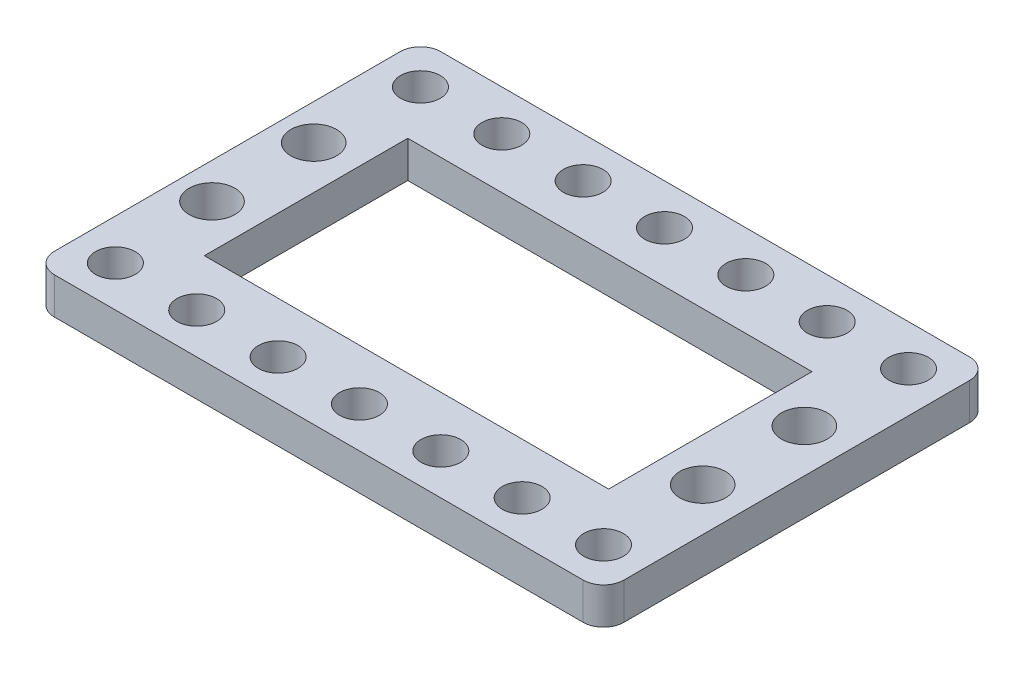
ISO-10303-21;
HEADER;
FILE_DESCRIPTION(('STEP AP214'),'2;1');
FILE_NAME('part.step','',(''),(''),'','','');
FILE_SCHEMA(('AUTOMOTIVE_DESIGN { 1 0 10303 214 1 1 1 1 }'));
ENDSEC;
DATA;
#1=APPLICATION_CONTEXT('core data for automotive mechanical design processes');
#2=APPLICATION_PROTOCOL_DEFINITION('international standard','automotive_design',2000,#1);
#3=PRODUCT_CONTEXT('',#1,'mechanical');
#4=PRODUCT('Part','Part','',(#3));
#5=PRODUCT_RELATED_PRODUCT_CATEGORY('part','',(#4));
#6=PRODUCT_DEFINITION_FORMATION('','',#4);
#7=PRODUCT_DEFINITION_CONTEXT('part definition',#1,'design');
#8=PRODUCT_DEFINITION('design','',#6,#7);
#9=PRODUCT_DEFINITION_SHAPE('','',#8);
#10=(LENGTH_UNIT() NAMED_UNIT(*) SI_UNIT(.MILLI.,.METRE.));
#11=(NAMED_UNIT(*) PLANE_ANGLE_UNIT() SI_UNIT($,.RADIAN.));
#12=(NAMED_UNIT(*) SI_UNIT($,.STERADIAN.) SOLID_ANGLE_UNIT());
#13=UNCERTAINTY_MEASURE_WITH_UNIT(LENGTH_MEASURE(1.E-05),#10,'distance_accuracy_value','');
#14=(GEOMETRIC_REPRESENTATION_CONTEXT(3) GLOBAL_UNCERTAINTY_ASSIGNED_CONTEXT((#13)) GLOBAL_UNIT_ASSIGNED_CONTEXT((#10,
#11,#12)) REPRESENTATION_CONTEXT('',''));
#15=CARTESIAN_POINT('',(0.,0.,0.));
#16=DIRECTION('',(0.,0.,1.));
#17=DIRECTION('',(1.,0.,0.));
#18=AXIS2_PLACEMENT_3D('',#15,#16,#17);
#19=CARTESIAN_POINT('',(76.,3.6,2.));
#20=DIRECTION('',(0.,-1.,0.));
#21=DIRECTION('',(0.,0.,-1.));
#22=AXIS2_PLACEMENT_3D('',#19,#20,#21);
#23=CYLINDRICAL_SURFACE('',#22,2.);
#24=DIRECTION('',(0.,-1.,0.));
#25=VECTOR('',#24,1.);
#26=CARTESIAN_POINT('',(76.,3.6,0.));
#27=LINE('',#26,#25);
#28=CARTESIAN_POINT('',(76.,3.6,0.));
#29=VERTEX_POINT('',#28);
#30=CARTESIAN_POINT('',(76.,0.,0.));
#31=VERTEX_POINT('',#30);
#32=EDGE_CURVE('E293',#29,#31,#27,.T.);
#33=ORIENTED_EDGE('',*,*,#32,.F.);
#34=CARTESIAN_POINT('',(76.,3.6,2.));
#35=DIRECTION('',(0.,1.,0.));
#36=DIRECTION('',(0.,0.,1.));
#37=AXIS2_PLACEMENT_3D('',#34,#35,#36);
#38=CIRCLE('',#37,2.);
#39=CARTESIAN_POINT('',(78.,3.6,2.));
#40=VERTEX_POINT('',#39);
#41=EDGE_CURVE('E41',#40,#29,#38,.T.);
#42=ORIENTED_EDGE('',*,*,#41,.F.);
#43=DIRECTION('',(0.,-1.,0.));
#44=VECTOR('',#43,1.);
#45=CARTESIAN_POINT('',(78.,-6.4,2.));
#46=LINE('',#45,#44);
#47=CARTESIAN_POINT('',(78.,0.,2.));
#48=VERTEX_POINT('',#47);
#49=EDGE_CURVE('E296',#48,#40,#46,.F.);
#50=ORIENTED_EDGE('',*,*,#49,.F.);
#51=CARTESIAN_POINT('',(76.,0.,2.));
#52=DIRECTION('',(0.,1.,0.));
#53=DIRECTION('',(0.,0.,1.));
#54=AXIS2_PLACEMENT_3D('',#51,#52,#53);
#55=CIRCLE('',#54,2.);
#56=EDGE_CURVE('E11',#31,#48,#55,.F.);
#57=ORIENTED_EDGE('',*,*,#56,.F.);
#58=EDGE_LOOP('',(#33,#42,#50,#57));
#59=FACE_BOUND('',#58,.T.);
#60=ADVANCED_FACE('F33',(#59),#23,.T.);
#61=CARTESIAN_POINT('',(76.,-6.4,36.));
#62=DIRECTION('',(0.,-1.,0.));
#63=DIRECTION('',(0.,0.,-1.));
#64=AXIS2_PLACEMENT_3D('',#61,#62,#63);
#65=CYLINDRICAL_SURFACE('',#64,2.);
#66=DIRECTION('',(0.,-1.,0.));
#67=VECTOR('',#66,1.);
#68=CARTESIAN_POINT('',(78.,-6.4,36.));
#69=LINE('',#68,#67);
#70=CARTESIAN_POINT('',(78.,3.6,36.));
#71=VERTEX_POINT('',#70);
#72=CARTESIAN_POINT('',(78.,0.,36.));
#73=VERTEX_POINT('',#72);
#74=EDGE_CURVE('E282',#71,#73,#69,.T.);
#75=ORIENTED_EDGE('',*,*,#74,.F.);
#76=CARTESIAN_POINT('',(76.,3.6,36.));
#77=DIRECTION('',(0.,1.,0.));
#78=DIRECTION('',(0.,0.,1.));
#79=AXIS2_PLACEMENT_3D('',#76,#77,#78);
#80=CIRCLE('',#79,2.);
#81=CARTESIAN_POINT('',(76.,3.6,38.));
#82=VERTEX_POINT('',#81);
#83=EDGE_CURVE('E288',#82,#71,#80,.T.);
#84=ORIENTED_EDGE('',*,*,#83,.F.);
#85=DIRECTION('',(0.,-1.,0.));
#86=VECTOR('',#85,1.);
#87=CARTESIAN_POINT('',(76.,3.6,38.));
#88=LINE('',#87,#86);
#89=CARTESIAN_POINT('',(76.,0.,38.));
#90=VERTEX_POINT('',#89);
#91=EDGE_CURVE('E285',#90,#82,#88,.F.);
#92=ORIENTED_EDGE('',*,*,#91,.F.);
#93=CARTESIAN_POINT('',(76.,0.,36.));
#94=DIRECTION('',(0.,1.,0.));
#95=DIRECTION('',(0.,0.,1.));
#96=AXIS2_PLACEMENT_3D('',#93,#94,#95);
#97=CIRCLE('',#96,2.);
#98=EDGE_CURVE('E291',#73,#90,#97,.F.);
#99=ORIENTED_EDGE('',*,*,#98,.F.);
#100=EDGE_LOOP('',(#75,#84,#92,#99));
#101=FACE_BOUND('',#100,.T.);
#102=ADVANCED_FACE('F350',(#101),#65,.T.);
#103=CARTESIAN_POINT('',(24.,-6.4,36.));
#104=DIRECTION('',(0.,1.,0.));
#105=DIRECTION('',(0.,0.,1.));
#106=AXIS2_PLACEMENT_3D('',#103,#104,#105);
#107=CYLINDRICAL_SURFACE('',#106,2.);
#108=DIRECTION('',(0.,1.,0.));
#109=VECTOR('',#108,1.);
#110=CARTESIAN_POINT('',(22.,-6.4,36.));
#111=LINE('',#110,#109);
#112=CARTESIAN_POINT('',(22.,0.,36.));
#113=VERTEX_POINT('',#112);
#114=CARTESIAN_POINT('',(22.,3.6,36.));
#115=VERTEX_POINT('',#114);
#116=EDGE_CURVE('E272',#113,#115,#111,.T.);
#117=ORIENTED_EDGE('',*,*,#116,.F.);
#118=CARTESIAN_POINT('',(24.,0.,36.));
#119=DIRECTION('',(0.,1.,0.));
#120=DIRECTION('',(0.,0.,1.));
#121=AXIS2_PLACEMENT_3D('',#118,#119,#120);
#122=CIRCLE('',#121,2.);
#123=CARTESIAN_POINT('',(24.,0.,38.));
#124=VERTEX_POINT('',#123);
#125=EDGE_CURVE('E278',#124,#113,#122,.F.);
#126=ORIENTED_EDGE('',*,*,#125,.F.);
#127=DIRECTION('',(0.,1.,0.));
#128=VECTOR('',#127,1.);
#129=CARTESIAN_POINT('',(24.,3.6,38.));
#130=LINE('',#129,#128);
#131=CARTESIAN_POINT('',(24.,3.6,38.));
#132=VERTEX_POINT('',#131);
#133=EDGE_CURVE('E275',#132,#124,#130,.F.);
#134=ORIENTED_EDGE('',*,*,#133,.F.);
#135=CARTESIAN_POINT('',(24.,3.6,36.));
#136=DIRECTION('',(0.,1.,0.));
#137=DIRECTION('',(0.,0.,1.));
#138=AXIS2_PLACEMENT_3D('',#135,#136,#137);
#139=CIRCLE('',#138,2.);
#140=EDGE_CURVE('E280',#115,#132,#139,.T.);
#141=ORIENTED_EDGE('',*,*,#140,.F.);
#142=EDGE_LOOP('',(#117,#126,#134,#141));
#143=FACE_BOUND('',#142,.T.);
#144=ADVANCED_FACE('F354',(#143),#107,.T.);
#145=CARTESIAN_POINT('',(24.,-6.4,2.));
#146=DIRECTION('',(0.,-1.,0.));
#147=DIRECTION('',(0.,0.,-1.));
#148=AXIS2_PLACEMENT_3D('',#145,#146,#147);
#149=CYLINDRICAL_SURFACE('',#148,2.);
#150=DIRECTION('',(0.,-1.,0.));
#151=VECTOR('',#150,1.);
#152=CARTESIAN_POINT('',(22.,-6.4,2.));
#153=LINE('',#152,#151);
#154=CARTESIAN_POINT('',(22.,3.6,2.));
#155=VERTEX_POINT('',#154);
#156=CARTESIAN_POINT('',(22.,0.,2.));
#157=VERTEX_POINT('',#156);
#158=EDGE_CURVE('E260',#155,#157,#153,.T.);
#159=ORIENTED_EDGE('',*,*,#158,.F.);
#160=CARTESIAN_POINT('',(24.,3.6,2.));
#161=DIRECTION('',(0.,1.,0.));
#162=DIRECTION('',(0.,0.,1.));
#163=AXIS2_PLACEMENT_3D('',#160,#161,#162);
#164=CIRCLE('',#163,2.);
#165=CARTESIAN_POINT('',(24.,3.6,0.));
#166=VERTEX_POINT('',#165);
#167=EDGE_CURVE('E266',#166,#155,#164,.T.);
#168=ORIENTED_EDGE('',*,*,#167,.F.);
#169=DIRECTION('',(0.,-1.,0.));
#170=VECTOR('',#169,1.);
#171=CARTESIAN_POINT('',(24.,3.6,0.));
#172=LINE('',#171,#170);
#173=CARTESIAN_POINT('',(24.,0.,0.));
#174=VERTEX_POINT('',#173);
#175=EDGE_CURVE('E263',#174,#166,#172,.F.);
#176=ORIENTED_EDGE('',*,*,#175,.F.);
#177=CARTESIAN_POINT('',(24.,0.,2.));
#178=DIRECTION('',(0.,1.,0.));
#179=DIRECTION('',(0.,0.,1.));
#180=AXIS2_PLACEMENT_3D('',#177,#178,#179);
#181=CIRCLE('',#180,2.);
#182=EDGE_CURVE('E269',#157,#174,#181,.F.);
#183=ORIENTED_EDGE('',*,*,#182,.F.);
#184=EDGE_LOOP('',(#159,#168,#176,#183));
#185=FACE_BOUND('',#184,.T.);
#186=ADVANCED_FACE('F366',(#185),#149,.T.);
#187=CARTESIAN_POINT('',(2.00000000000001,3.6,0.));
#188=DIRECTION('',(0.,0.,1.));
#189=DIRECTION('',(1.,0.,0.));
#190=AXIS2_PLACEMENT_3D('',#187,#188,#189);
#191=PLANE('',#190);
#192=DIRECTION('',(-1.,0.,0.));
#193=VECTOR('',#192,1.);
#194=CARTESIAN_POINT('',(2.00000000000001,3.6,0.));
#195=LINE('',#194,#193);
#196=EDGE_CURVE('E247',#29,#166,#195,.T.);
#197=ORIENTED_EDGE('',*,*,#196,.F.);
#198=ORIENTED_EDGE('',*,*,#32,.T.);
#199=DIRECTION('',(-1.,0.,0.));
#200=VECTOR('',#199,1.);
#201=CARTESIAN_POINT('',(2.00000000000001,0.,0.));
#202=LINE('',#201,#200);
#203=EDGE_CURVE('E238',#31,#174,#202,.T.);
#204=ORIENTED_EDGE('',*,*,#203,.T.);
#205=ORIENTED_EDGE('',*,*,#175,.T.);
#206=EDGE_LOOP('',(#197,#198,#204,#205));
#207=FACE_BOUND('',#206,.T.);
#208=ADVANCED_FACE('F358',(#207),#191,.F.);
#209=CARTESIAN_POINT('',(2.,3.6,38.));
#210=DIRECTION('',(0.,0.,-1.));
#211=DIRECTION('',(-1.,0.,0.));
#212=AXIS2_PLACEMENT_3D('',#209,#210,#211);
#213=PLANE('',#212);
#214=DIRECTION('',(1.,0.,0.));
#215=VECTOR('',#214,1.);
#216=CARTESIAN_POINT('',(2.,0.,38.));
#217=LINE('',#216,#215);
#218=EDGE_CURVE('E250',#124,#90,#217,.T.);
#219=ORIENTED_EDGE('',*,*,#218,.T.);
#220=ORIENTED_EDGE('',*,*,#91,.T.);
#221=DIRECTION('',(1.,0.,0.));
#222=VECTOR('',#221,1.);
#223=CARTESIAN_POINT('',(2.,3.6,38.));
#224=LINE('',#223,#222);
#225=EDGE_CURVE('E249',#132,#82,#224,.T.);
#226=ORIENTED_EDGE('',*,*,#225,.F.);
#227=ORIENTED_EDGE('',*,*,#133,.T.);
#228=EDGE_LOOP('',(#219,#220,#226,#227));
#229=FACE_BOUND('',#228,.T.);
#230=ADVANCED_FACE('F328',(#229),#213,.F.);
#231=CARTESIAN_POINT('',(98.,3.6,36.));
#232=DIRECTION('',(0.,1.,0.));
#233=DIRECTION('',(0.,0.,1.));
#234=AXIS2_PLACEMENT_3D('',#231,#232,#233);
#235=PLANE('',#234);
#236=CARTESIAN_POINT('',(73.75,3.6,24.));
#237=DIRECTION('',(0.,1.,0.));
#238=DIRECTION('',(0.,0.,1.));
#239=AXIS2_PLACEMENT_3D('',#236,#237,#238);
#240=CIRCLE('',#239,2.25);
#241=CARTESIAN_POINT('',(73.75,3.6,26.25));
#242=VERTEX_POINT('',#241);
#243=EDGE_CURVE('E607',#242,#242,#240,.T.);
#244=ORIENTED_EDGE('',*,*,#243,.F.);
#245=EDGE_LOOP('',(#244));
#246=FACE_BOUND('',#245,.T.);
#247=CARTESIAN_POINT('',(25.5,3.6,14.));
#248=DIRECTION('',(0.,1.,0.));
#249=DIRECTION('',(0.,0.,1.));
#250=AXIS2_PLACEMENT_3D('',#247,#248,#249);
#251=CIRCLE('',#250,2.25);
#252=CARTESIAN_POINT('',(25.5,3.6,16.25));
#253=VERTEX_POINT('',#252);
#254=EDGE_CURVE('E608',#253,#253,#251,.T.);
#255=ORIENTED_EDGE('',*,*,#254,.F.);
#256=EDGE_LOOP('',(#255));
#257=FACE_BOUND('',#256,.T.);
#258=CARTESIAN_POINT('',(25.5,3.6,24.));
#259=DIRECTION('',(0.,1.,0.));
#260=DIRECTION('',(0.,0.,1.));
#261=AXIS2_PLACEMENT_3D('',#258,#259,#260);
#262=CIRCLE('',#261,2.25);
#263=CARTESIAN_POINT('',(25.5,3.6,26.25));
#264=VERTEX_POINT('',#263);
#265=EDGE_CURVE('E612',#264,#264,#262,.T.);
#266=ORIENTED_EDGE('',*,*,#265,.F.);
#267=EDGE_LOOP('',(#266));
#268=FACE_BOUND('',#267,.T.);
#269=CARTESIAN_POINT('',(73.75,3.6,14.));
#270=DIRECTION('',(0.,1.,0.));
#271=DIRECTION('',(0.,0.,1.));
#272=AXIS2_PLACEMENT_3D('',#269,#270,#271);
#273=CIRCLE('',#272,2.25);
#274=CARTESIAN_POINT('',(73.75,3.6,16.25));
#275=VERTEX_POINT('',#274);
#276=EDGE_CURVE('E303',#275,#275,#273,.T.);
#277=ORIENTED_EDGE('',*,*,#276,.F.);
#278=EDGE_LOOP('',(#277));
#279=FACE_BOUND('',#278,.T.);
#280=DIRECTION('',(0.,0.,1.));
#281=VECTOR('',#280,1.);
#282=CARTESIAN_POINT('',(78.,3.6,0.));
#283=LINE('',#282,#281);
#284=EDGE_CURVE('E158',#40,#71,#283,.T.);
#285=ORIENTED_EDGE('',*,*,#284,.F.);
#286=ORIENTED_EDGE('',*,*,#41,.T.);
#287=ORIENTED_EDGE('',*,*,#196,.T.);
#288=ORIENTED_EDGE('',*,*,#167,.T.);
#289=DIRECTION('',(0.,0.,-1.));
#290=VECTOR('',#289,1.);
#291=CARTESIAN_POINT('',(22.,3.6,0.));
#292=LINE('',#291,#290);
#293=EDGE_CURVE('E310',#115,#155,#292,.T.);
#294=ORIENTED_EDGE('',*,*,#293,.F.);
#295=ORIENTED_EDGE('',*,*,#140,.T.);
#296=ORIENTED_EDGE('',*,*,#225,.T.);
#297=ORIENTED_EDGE('',*,*,#83,.T.);
#298=EDGE_LOOP('',(#285,#286,#287,#288,#294,#295,#296,#297));
#299=FACE_BOUND('',#298,.T.);
#300=CARTESIAN_POINT('',(74.,3.6,4.0047502203254));
#301=DIRECTION('',(0.,1.,0.));
#302=DIRECTION('',(0.,0.,1.));
#303=AXIS2_PLACEMENT_3D('',#300,#301,#302);
#304=CIRCLE('',#303,1.95);
#305=CARTESIAN_POINT('',(74.,3.6,5.9547502203254));
#306=VERTEX_POINT('',#305);
#307=EDGE_CURVE('E184',#306,#306,#304,.T.);
#308=ORIENTED_EDGE('',*,*,#307,.F.);
#309=EDGE_LOOP('',(#308));
#310=FACE_BOUND('',#309,.T.);
#311=CARTESIAN_POINT('',(26.,3.6,34.));
#312=DIRECTION('',(0.,1.,0.));
#313=DIRECTION('',(0.,0.,1.));
#314=AXIS2_PLACEMENT_3D('',#311,#312,#313);
#315=CIRCLE('',#314,1.95);
#316=CARTESIAN_POINT('',(26.,3.6,35.95));
#317=VERTEX_POINT('',#316);
#318=EDGE_CURVE('E185',#317,#317,#315,.T.);
#319=ORIENTED_EDGE('',*,*,#318,.F.);
#320=EDGE_LOOP('',(#319));
#321=FACE_BOUND('',#320,.T.);
#322=CARTESIAN_POINT('',(34.,3.6,34.));
#323=DIRECTION('',(0.,1.,0.));
#324=DIRECTION('',(0.,0.,1.));
#325=AXIS2_PLACEMENT_3D('',#322,#323,#324);
#326=CIRCLE('',#325,1.94999999999999);
#327=CARTESIAN_POINT('',(34.,3.6,35.95));
#328=VERTEX_POINT('',#327);
#329=EDGE_CURVE('E191',#328,#328,#326,.T.);
#330=ORIENTED_EDGE('',*,*,#329,.F.);
#331=EDGE_LOOP('',(#330));
#332=FACE_BOUND('',#331,.T.);
#333=CARTESIAN_POINT('',(42.,3.6,34.));
#334=DIRECTION('',(0.,1.,0.));
#335=DIRECTION('',(0.,0.,1.));
#336=AXIS2_PLACEMENT_3D('',#333,#334,#335);
#337=CIRCLE('',#336,1.95000000000001);
#338=CARTESIAN_POINT('',(42.,3.6,35.95));
#339=VERTEX_POINT('',#338);
#340=EDGE_CURVE('E197',#339,#339,#337,.T.);
#341=ORIENTED_EDGE('',*,*,#340,.F.);
#342=EDGE_LOOP('',(#341));
#343=FACE_BOUND('',#342,.T.);
#344=CARTESIAN_POINT('',(50.,3.6,34.));
#345=DIRECTION('',(0.,1.,0.));
#346=DIRECTION('',(0.,0.,1.));
#347=AXIS2_PLACEMENT_3D('',#344,#345,#346);
#348=CIRCLE('',#347,1.95);
#349=CARTESIAN_POINT('',(50.,3.6,35.95));
#350=VERTEX_POINT('',#349);
#351=EDGE_CURVE('E170',#350,#350,#348,.T.);
#352=ORIENTED_EDGE('',*,*,#351,.F.);
#353=EDGE_LOOP('',(#352));
#354=FACE_BOUND('',#353,.T.);
#355=CARTESIAN_POINT('',(34.,3.6,4.00475022032541));
#356=DIRECTION('',(0.,1.,0.));
#357=DIRECTION('',(0.,0.,1.));
#358=AXIS2_PLACEMENT_3D('',#355,#356,#357);
#359=CIRCLE('',#358,1.95);
#360=CARTESIAN_POINT('',(34.,3.6,5.95475022032541));
#361=VERTEX_POINT('',#360);
#362=EDGE_CURVE('E214',#361,#361,#359,.T.);
#363=ORIENTED_EDGE('',*,*,#362,.F.);
#364=EDGE_LOOP('',(#363));
#365=FACE_BOUND('',#364,.T.);
#366=CARTESIAN_POINT('',(26.,3.6,4.00475022032541));
#367=DIRECTION('',(0.,1.,0.));
#368=DIRECTION('',(0.,0.,1.));
#369=AXIS2_PLACEMENT_3D('',#366,#367,#368);
#370=CIRCLE('',#369,1.95);
#371=CARTESIAN_POINT('',(26.,3.6,5.95475022032541));
#372=VERTEX_POINT('',#371);
#373=EDGE_CURVE('E239',#372,#372,#370,.T.);
#374=ORIENTED_EDGE('',*,*,#373,.F.);
#375=EDGE_LOOP('',(#374));
#376=FACE_BOUND('',#375,.T.);
#377=CARTESIAN_POINT('',(42.,3.6,4.00475022032541));
#378=DIRECTION('',(0.,1.,0.));
#379=DIRECTION('',(0.,0.,1.));
#380=AXIS2_PLACEMENT_3D('',#377,#378,#379);
#381=CIRCLE('',#380,1.95000000000001);
#382=CARTESIAN_POINT('',(42.,3.6,5.95475022032541));
#383=VERTEX_POINT('',#382);
#384=EDGE_CURVE('E215',#383,#383,#381,.T.);
#385=ORIENTED_EDGE('',*,*,#384,.F.);
#386=EDGE_LOOP('',(#385));
#387=FACE_BOUND('',#386,.T.);
#388=CARTESIAN_POINT('',(50.,3.6,4.00475022032541));
#389=DIRECTION('',(0.,1.,0.));
#390=DIRECTION('',(0.,0.,1.));
#391=AXIS2_PLACEMENT_3D('',#388,#389,#390);
#392=CIRCLE('',#391,1.95);
#393=CARTESIAN_POINT('',(50.,3.6,5.95475022032541));
#394=VERTEX_POINT('',#393);
#395=EDGE_CURVE('E221',#394,#394,#392,.T.);
#396=ORIENTED_EDGE('',*,*,#395,.F.);
#397=EDGE_LOOP('',(#396));
#398=FACE_BOUND('',#397,.T.);
#399=CARTESIAN_POINT('',(58.,3.6,4.00475022032541));
#400=DIRECTION('',(0.,1.,0.));
#401=DIRECTION('',(0.,0.,1.));
#402=AXIS2_PLACEMENT_3D('',#399,#400,#401);
#403=CIRCLE('',#402,1.95);
#404=CARTESIAN_POINT('',(58.,3.6,5.9547502203254));
#405=VERTEX_POINT('',#404);
#406=EDGE_CURVE('E227',#405,#405,#403,.T.);
#407=ORIENTED_EDGE('',*,*,#406,.F.);
#408=EDGE_LOOP('',(#407));
#409=FACE_BOUND('',#408,.T.);
#410=CARTESIAN_POINT('',(66.,3.6,4.00475022032541));
#411=DIRECTION('',(0.,1.,0.));
#412=DIRECTION('',(0.,0.,1.));
#413=AXIS2_PLACEMENT_3D('',#410,#411,#412);
#414=CIRCLE('',#413,1.95);
#415=CARTESIAN_POINT('',(66.,3.6,5.9547502203254));
#416=VERTEX_POINT('',#415);
#417=EDGE_CURVE('E208',#416,#416,#414,.T.);
#418=ORIENTED_EDGE('',*,*,#417,.F.);
#419=EDGE_LOOP('',(#418));
#420=FACE_BOUND('',#419,.T.);
#421=DIRECTION('',(0.,0.,1.));
#422=VECTOR('',#421,1.);
#423=CARTESIAN_POINT('',(29.75,3.6,9.));
#424=LINE('',#423,#422);
#425=CARTESIAN_POINT('',(29.75,3.6,9.));
#426=VERTEX_POINT('',#425);
#427=CARTESIAN_POINT('',(29.75,3.6,29.));
#428=VERTEX_POINT('',#427);
#429=EDGE_CURVE('E127',#426,#428,#424,.T.);
#430=ORIENTED_EDGE('',*,*,#429,.F.);
#431=DIRECTION('',(-1.,0.,0.));
#432=VECTOR('',#431,1.);
#433=CARTESIAN_POINT('',(29.75,3.6,9.));
#434=LINE('',#433,#432);
#435=CARTESIAN_POINT('',(69.5,3.6,9.));
#436=VERTEX_POINT('',#435);
#437=EDGE_CURVE('E145',#436,#426,#434,.T.);
#438=ORIENTED_EDGE('',*,*,#437,.F.);
#439=DIRECTION('',(0.,0.,-1.));
#440=VECTOR('',#439,1.);
#441=CARTESIAN_POINT('',(69.5,3.6,9.));
#442=LINE('',#441,#440);
#443=CARTESIAN_POINT('',(69.5,3.6,29.));
#444=VERTEX_POINT('',#443);
#445=EDGE_CURVE('E148',#444,#436,#442,.T.);
#446=ORIENTED_EDGE('',*,*,#445,.F.);
#447=DIRECTION('',(1.,0.,0.));
#448=VECTOR('',#447,1.);
#449=CARTESIAN_POINT('',(29.75,3.6,29.));
#450=LINE('',#449,#448);
#451=EDGE_CURVE('E157',#428,#444,#450,.T.);
#452=ORIENTED_EDGE('',*,*,#451,.F.);
#453=EDGE_LOOP('',(#430,#438,#446,#452));
#454=FACE_BOUND('',#453,.T.);
#455=CARTESIAN_POINT('',(74.,3.6,34.));
#456=DIRECTION('',(0.,1.,0.));
#457=DIRECTION('',(0.,0.,1.));
#458=AXIS2_PLACEMENT_3D('',#455,#456,#457);
#459=CIRCLE('',#458,1.95);
#460=CARTESIAN_POINT('',(74.,3.6,35.95));
#461=VERTEX_POINT('',#460);
#462=EDGE_CURVE('E151',#461,#461,#459,.T.);
#463=ORIENTED_EDGE('',*,*,#462,.F.);
#464=EDGE_LOOP('',(#463));
#465=FACE_BOUND('',#464,.T.);
#466=CARTESIAN_POINT('',(66.,3.6,34.));
#467=DIRECTION('',(0.,1.,0.));
#468=DIRECTION('',(0.,0.,1.));
#469=AXIS2_PLACEMENT_3D('',#466,#467,#468);
#470=CIRCLE('',#469,1.95);
#471=CARTESIAN_POINT('',(66.,3.6,35.95));
#472=VERTEX_POINT('',#471);
#473=EDGE_CURVE('E177',#472,#472,#470,.T.);
#474=ORIENTED_EDGE('',*,*,#473,.F.);
#475=EDGE_LOOP('',(#474));
#476=FACE_BOUND('',#475,.T.);
#477=CARTESIAN_POINT('',(58.,3.6,34.));
#478=DIRECTION('',(0.,1.,0.));
#479=DIRECTION('',(0.,0.,1.));
#480=AXIS2_PLACEMENT_3D('',#477,#478,#479);
#481=CIRCLE('',#480,1.95);
#482=CARTESIAN_POINT('',(58.,3.6,35.95));
#483=VERTEX_POINT('',#482);
#484=EDGE_CURVE('E171',#483,#483,#481,.T.);
#485=ORIENTED_EDGE('',*,*,#484,.F.);
#486=EDGE_LOOP('',(#485));
#487=FACE_BOUND('',#486,.T.);
#488=ADVANCED_FACE('F325',(#246,#257,#268,#279,#299,#310,#321,#332,#343,#354,#365,#376,#387,
#398,#409,#420,#454,#465,#476,#487),#235,.T.);
#489=CARTESIAN_POINT('',(98.,0.,36.));
#490=DIRECTION('',(0.,1.,0.));
#491=DIRECTION('',(0.,0.,1.));
#492=AXIS2_PLACEMENT_3D('',#489,#490,#491);
#493=PLANE('',#492);
#494=CARTESIAN_POINT('',(73.75,0.,24.));
#495=DIRECTION('',(0.,1.,0.));
#496=DIRECTION('',(0.,0.,1.));
#497=AXIS2_PLACEMENT_3D('',#494,#495,#496);
#498=CIRCLE('',#497,2.25);
#499=CARTESIAN_POINT('',(73.75,0.,26.25));
#500=VERTEX_POINT('',#499);
#501=EDGE_CURVE('E36',#500,#500,#498,.T.);
#502=ORIENTED_EDGE('',*,*,#501,.T.);
#503=EDGE_LOOP('',(#502));
#504=FACE_BOUND('',#503,.T.);
#505=CARTESIAN_POINT('',(25.5,0.,14.));
#506=DIRECTION('',(0.,1.,0.));
#507=DIRECTION('',(0.,0.,1.));
#508=AXIS2_PLACEMENT_3D('',#505,#506,#507);
#509=CIRCLE('',#508,2.25);
#510=CARTESIAN_POINT('',(25.5,0.,16.25));
#511=VERTEX_POINT('',#510);
#512=EDGE_CURVE('E305',#511,#511,#509,.T.);
#513=ORIENTED_EDGE('',*,*,#512,.T.);
#514=EDGE_LOOP('',(#513));
#515=FACE_BOUND('',#514,.T.);
#516=CARTESIAN_POINT('',(25.5,0.,24.));
#517=DIRECTION('',(0.,1.,0.));
#518=DIRECTION('',(0.,0.,1.));
#519=AXIS2_PLACEMENT_3D('',#516,#517,#518);
#520=CIRCLE('',#519,2.25);
#521=CARTESIAN_POINT('',(25.5,0.,26.25));
#522=VERTEX_POINT('',#521);
#523=EDGE_CURVE('E302',#522,#522,#520,.T.);
#524=ORIENTED_EDGE('',*,*,#523,.T.);
#525=EDGE_LOOP('',(#524));
#526=FACE_BOUND('',#525,.T.);
#527=CARTESIAN_POINT('',(73.75,0.,14.));
#528=DIRECTION('',(0.,1.,0.));
#529=DIRECTION('',(0.,0.,1.));
#530=AXIS2_PLACEMENT_3D('',#527,#528,#529);
#531=CIRCLE('',#530,2.25);
#532=CARTESIAN_POINT('',(73.75,0.,16.25));
#533=VERTEX_POINT('',#532);
#534=EDGE_CURVE('E299',#533,#533,#531,.T.);
#535=ORIENTED_EDGE('',*,*,#534,.T.);
#536=EDGE_LOOP('',(#535));
#537=FACE_BOUND('',#536,.T.);
#538=CARTESIAN_POINT('',(74.,0.,4.0047502203254));
#539=DIRECTION('',(0.,1.,0.));
#540=DIRECTION('',(0.,0.,1.));
#541=AXIS2_PLACEMENT_3D('',#538,#539,#540);
#542=CIRCLE('',#541,1.95);
#543=CARTESIAN_POINT('',(74.,0.,5.9547502203254));
#544=VERTEX_POINT('',#543);
#545=EDGE_CURVE('E205',#544,#544,#542,.T.);
#546=ORIENTED_EDGE('',*,*,#545,.T.);
#547=EDGE_LOOP('',(#546));
#548=FACE_BOUND('',#547,.T.);
#549=CARTESIAN_POINT('',(26.,0.,34.));
#550=DIRECTION('',(0.,1.,0.));
#551=DIRECTION('',(0.,0.,1.));
#552=AXIS2_PLACEMENT_3D('',#549,#550,#551);
#553=CIRCLE('',#552,1.95);
#554=CARTESIAN_POINT('',(26.,0.,35.95));
#555=VERTEX_POINT('',#554);
#556=EDGE_CURVE('E181',#555,#555,#553,.T.);
#557=ORIENTED_EDGE('',*,*,#556,.T.);
#558=EDGE_LOOP('',(#557));
#559=FACE_BOUND('',#558,.T.);
#560=CARTESIAN_POINT('',(34.,0.,34.));
#561=DIRECTION('',(0.,1.,0.));
#562=DIRECTION('',(0.,0.,1.));
#563=AXIS2_PLACEMENT_3D('',#560,#561,#562);
#564=CIRCLE('',#563,1.94999999999999);
#565=CARTESIAN_POINT('',(34.,0.,35.95));
#566=VERTEX_POINT('',#565);
#567=EDGE_CURVE('E188',#566,#566,#564,.T.);
#568=ORIENTED_EDGE('',*,*,#567,.T.);
#569=EDGE_LOOP('',(#568));
#570=FACE_BOUND('',#569,.T.);
#571=CARTESIAN_POINT('',(42.,0.,34.));
#572=DIRECTION('',(0.,1.,0.));
#573=DIRECTION('',(0.,0.,1.));
#574=AXIS2_PLACEMENT_3D('',#571,#572,#573);
#575=CIRCLE('',#574,1.95000000000001);
#576=CARTESIAN_POINT('',(42.,0.,35.95));
#577=VERTEX_POINT('',#576);
#578=EDGE_CURVE('E194',#577,#577,#575,.T.);
#579=ORIENTED_EDGE('',*,*,#578,.T.);
#580=EDGE_LOOP('',(#579));
#581=FACE_BOUND('',#580,.T.);
#582=CARTESIAN_POINT('',(50.,0.,34.));
#583=DIRECTION('',(0.,1.,0.));
#584=DIRECTION('',(0.,0.,1.));
#585=AXIS2_PLACEMENT_3D('',#582,#583,#584);
#586=CIRCLE('',#585,1.95);
#587=CARTESIAN_POINT('',(50.,0.,35.95));
#588=VERTEX_POINT('',#587);
#589=EDGE_CURVE('E200',#588,#588,#586,.T.);
#590=ORIENTED_EDGE('',*,*,#589,.T.);
#591=EDGE_LOOP('',(#590));
#592=FACE_BOUND('',#591,.T.);
#593=CARTESIAN_POINT('',(34.,0.,4.00475022032541));
#594=DIRECTION('',(0.,1.,0.));
#595=DIRECTION('',(0.,0.,1.));
#596=AXIS2_PLACEMENT_3D('',#593,#594,#595);
#597=CIRCLE('',#596,1.95);
#598=CARTESIAN_POINT('',(34.,0.,5.95475022032541));
#599=VERTEX_POINT('',#598);
#600=EDGE_CURVE('E242',#599,#599,#597,.T.);
#601=ORIENTED_EDGE('',*,*,#600,.T.);
#602=EDGE_LOOP('',(#601));
#603=FACE_BOUND('',#602,.T.);
#604=CARTESIAN_POINT('',(26.,0.,4.00475022032541));
#605=DIRECTION('',(0.,1.,0.));
#606=DIRECTION('',(0.,0.,1.));
#607=AXIS2_PLACEMENT_3D('',#604,#605,#606);
#608=CIRCLE('',#607,1.95);
#609=CARTESIAN_POINT('',(26.,0.,5.95475022032541));
#610=VERTEX_POINT('',#609);
#611=EDGE_CURVE('E235',#610,#610,#608,.T.);
#612=ORIENTED_EDGE('',*,*,#611,.T.);
#613=EDGE_LOOP('',(#612));
#614=FACE_BOUND('',#613,.T.);
#615=CARTESIAN_POINT('',(42.,0.,4.00475022032541));
#616=DIRECTION('',(0.,1.,0.));
#617=DIRECTION('',(0.,0.,1.));
#618=AXIS2_PLACEMENT_3D('',#615,#616,#617);
#619=CIRCLE('',#618,1.95000000000001);
#620=CARTESIAN_POINT('',(42.,0.,5.95475022032541));
#621=VERTEX_POINT('',#620);
#622=EDGE_CURVE('E211',#621,#621,#619,.T.);
#623=ORIENTED_EDGE('',*,*,#622,.T.);
#624=EDGE_LOOP('',(#623));
#625=FACE_BOUND('',#624,.T.);
#626=CARTESIAN_POINT('',(50.,0.,4.00475022032541));
#627=DIRECTION('',(0.,1.,0.));
#628=DIRECTION('',(0.,0.,1.));
#629=AXIS2_PLACEMENT_3D('',#626,#627,#628);
#630=CIRCLE('',#629,1.95);
#631=CARTESIAN_POINT('',(50.,0.,5.95475022032541));
#632=VERTEX_POINT('',#631);
#633=EDGE_CURVE('E218',#632,#632,#630,.T.);
#634=ORIENTED_EDGE('',*,*,#633,.T.);
#635=EDGE_LOOP('',(#634));
#636=FACE_BOUND('',#635,.T.);
#637=CARTESIAN_POINT('',(58.,0.,4.00475022032541));
#638=DIRECTION('',(0.,1.,0.));
#639=DIRECTION('',(0.,0.,1.));
#640=AXIS2_PLACEMENT_3D('',#637,#638,#639);
#641=CIRCLE('',#640,1.95);
#642=CARTESIAN_POINT('',(58.,0.,5.9547502203254));
#643=VERTEX_POINT('',#642);
#644=EDGE_CURVE('E224',#643,#643,#641,.T.);
#645=ORIENTED_EDGE('',*,*,#644,.T.);
#646=EDGE_LOOP('',(#645));
#647=FACE_BOUND('',#646,.T.);
#648=CARTESIAN_POINT('',(66.,0.,4.00475022032541));
#649=DIRECTION('',(0.,1.,0.));
#650=DIRECTION('',(0.,0.,1.));
#651=AXIS2_PLACEMENT_3D('',#648,#649,#650);
#652=CIRCLE('',#651,1.95);
#653=CARTESIAN_POINT('',(66.,0.,5.9547502203254));
#654=VERTEX_POINT('',#653);
#655=EDGE_CURVE('E230',#654,#654,#652,.T.);
#656=ORIENTED_EDGE('',*,*,#655,.T.);
#657=EDGE_LOOP('',(#656));
#658=FACE_BOUND('',#657,.T.);
#659=DIRECTION('',(-1.,0.,0.));
#660=VECTOR('',#659,1.);
#661=CARTESIAN_POINT('',(29.75,0.,9.));
#662=LINE('',#661,#660);
#663=CARTESIAN_POINT('',(69.5,0.,9.));
#664=VERTEX_POINT('',#663);
#665=CARTESIAN_POINT('',(29.75,0.,9.));
#666=VERTEX_POINT('',#665);
#667=EDGE_CURVE('E132',#664,#666,#662,.T.);
#668=ORIENTED_EDGE('',*,*,#667,.T.);
#669=DIRECTION('',(0.,0.,1.));
#670=VECTOR('',#669,1.);
#671=CARTESIAN_POINT('',(29.75,0.,9.));
#672=LINE('',#671,#670);
#673=CARTESIAN_POINT('',(29.75,0.,29.));
#674=VERTEX_POINT('',#673);
#675=EDGE_CURVE('E124',#666,#674,#672,.T.);
#676=ORIENTED_EDGE('',*,*,#675,.T.);
#677=DIRECTION('',(1.,0.,0.));
#678=VECTOR('',#677,1.);
#679=CARTESIAN_POINT('',(29.75,0.,29.));
#680=LINE('',#679,#678);
#681=CARTESIAN_POINT('',(69.5,0.,29.));
#682=VERTEX_POINT('',#681);
#683=EDGE_CURVE('E136',#674,#682,#680,.T.);
#684=ORIENTED_EDGE('',*,*,#683,.T.);
#685=DIRECTION('',(0.,0.,-1.));
#686=VECTOR('',#685,1.);
#687=CARTESIAN_POINT('',(69.5,0.,9.));
#688=LINE('',#687,#686);
#689=EDGE_CURVE('E140',#682,#664,#688,.T.);
#690=ORIENTED_EDGE('',*,*,#689,.T.);
#691=EDGE_LOOP('',(#668,#676,#684,#690));
#692=FACE_BOUND('',#691,.T.);
#693=CARTESIAN_POINT('',(74.,0.,34.));
#694=DIRECTION('',(0.,1.,0.));
#695=DIRECTION('',(0.,0.,1.));
#696=AXIS2_PLACEMENT_3D('',#693,#694,#695);
#697=CIRCLE('',#696,1.95);
#698=CARTESIAN_POINT('',(74.,0.,35.95));
#699=VERTEX_POINT('',#698);
#700=EDGE_CURVE('E180',#699,#699,#697,.T.);
#701=ORIENTED_EDGE('',*,*,#700,.T.);
#702=EDGE_LOOP('',(#701));
#703=FACE_BOUND('',#702,.T.);
#704=CARTESIAN_POINT('',(66.,0.,34.));
#705=DIRECTION('',(0.,1.,0.));
#706=DIRECTION('',(0.,0.,1.));
#707=AXIS2_PLACEMENT_3D('',#704,#705,#706);
#708=CIRCLE('',#707,1.95);
#709=CARTESIAN_POINT('',(66.,0.,35.95));
#710=VERTEX_POINT('',#709);
#711=EDGE_CURVE('E174',#710,#710,#708,.T.);
#712=ORIENTED_EDGE('',*,*,#711,.T.);
#713=EDGE_LOOP('',(#712));
#714=FACE_BOUND('',#713,.T.);
#715=CARTESIAN_POINT('',(58.,0.,34.));
#716=DIRECTION('',(0.,1.,0.));
#717=DIRECTION('',(0.,0.,1.));
#718=AXIS2_PLACEMENT_3D('',#715,#716,#717);
#719=CIRCLE('',#718,1.95);
#720=CARTESIAN_POINT('',(58.,0.,35.95));
#721=VERTEX_POINT('',#720);
#722=EDGE_CURVE('E167',#721,#721,#719,.T.);
#723=ORIENTED_EDGE('',*,*,#722,.T.);
#724=EDGE_LOOP('',(#723));
#725=FACE_BOUND('',#724,.T.);
#726=ORIENTED_EDGE('',*,*,#203,.F.);
#727=ORIENTED_EDGE('',*,*,#56,.T.);
#728=DIRECTION('',(0.,0.,1.));
#729=VECTOR('',#728,1.);
#730=CARTESIAN_POINT('',(78.,0.,36.));
#731=LINE('',#730,#729);
#732=EDGE_CURVE('E258',#48,#73,#731,.T.);
#733=ORIENTED_EDGE('',*,*,#732,.T.);
#734=ORIENTED_EDGE('',*,*,#98,.T.);
#735=ORIENTED_EDGE('',*,*,#218,.F.);
#736=ORIENTED_EDGE('',*,*,#125,.T.);
#737=DIRECTION('',(0.,0.,-1.));
#738=VECTOR('',#737,1.);
#739=CARTESIAN_POINT('',(22.,0.,36.));
#740=LINE('',#739,#738);
#741=EDGE_CURVE('E253',#113,#157,#740,.T.);
#742=ORIENTED_EDGE('',*,*,#741,.T.);
#743=ORIENTED_EDGE('',*,*,#182,.T.);
#744=EDGE_LOOP('',(#726,#727,#733,#734,#735,#736,#742,#743));
#745=FACE_BOUND('',#744,.T.);
#746=ADVANCED_FACE('F142',(#504,#515,#526,#537,#548,#559,#570,#581,#592,#603,#614,#625,#636,
#647,#658,#692,#703,#714,#725,#745),#493,.F.);
#747=CARTESIAN_POINT('',(58.,0.,34.));
#748=DIRECTION('',(0.,1.,0.));
#749=DIRECTION('',(0.,0.,1.));
#750=AXIS2_PLACEMENT_3D('',#747,#748,#749);
#751=CYLINDRICAL_SURFACE('',#750,1.95);
#752=ORIENTED_EDGE('',*,*,#722,.F.);
#753=EDGE_LOOP('',(#752));
#754=FACE_BOUND('',#753,.T.);
#755=ORIENTED_EDGE('',*,*,#484,.T.);
#756=EDGE_LOOP('',(#755));
#757=FACE_BOUND('',#756,.T.);
#758=ADVANCED_FACE('F335',(#754,#757),#751,.F.);
#759=CARTESIAN_POINT('',(66.,0.,34.));
#760=DIRECTION('',(0.,1.,0.));
#761=DIRECTION('',(0.,0.,1.));
#762=AXIS2_PLACEMENT_3D('',#759,#760,#761);
#763=CYLINDRICAL_SURFACE('',#762,1.95);
#764=ORIENTED_EDGE('',*,*,#711,.F.);
#765=EDGE_LOOP('',(#764));
#766=FACE_BOUND('',#765,.T.);
#767=ORIENTED_EDGE('',*,*,#473,.T.);
#768=EDGE_LOOP('',(#767));
#769=FACE_BOUND('',#768,.T.);
#770=ADVANCED_FACE('F337',(#766,#769),#763,.F.);
#771=CARTESIAN_POINT('',(74.,0.,34.));
#772=DIRECTION('',(0.,1.,0.));
#773=DIRECTION('',(0.,0.,1.));
#774=AXIS2_PLACEMENT_3D('',#771,#772,#773);
#775=CYLINDRICAL_SURFACE('',#774,1.95);
#776=ORIENTED_EDGE('',*,*,#700,.F.);
#777=EDGE_LOOP('',(#776));
#778=FACE_BOUND('',#777,.T.);
#779=ORIENTED_EDGE('',*,*,#462,.T.);
#780=EDGE_LOOP('',(#779));
#781=FACE_BOUND('',#780,.T.);
#782=ADVANCED_FACE('F323',(#778,#781),#775,.F.);
#783=CARTESIAN_POINT('',(29.75,0.,9.));
#784=DIRECTION('',(-1.,0.,0.));
#785=DIRECTION('',(0.,0.,1.));
#786=AXIS2_PLACEMENT_3D('',#783,#784,#785);
#787=PLANE('',#786);
#788=ORIENTED_EDGE('',*,*,#429,.T.);
#789=DIRECTION('',(0.,1.,0.));
#790=VECTOR('',#789,1.);
#791=CARTESIAN_POINT('',(29.75,0.,29.));
#792=LINE('',#791,#790);
#793=EDGE_CURVE('E120',#674,#428,#792,.T.);
#794=ORIENTED_EDGE('',*,*,#793,.F.);
#795=ORIENTED_EDGE('',*,*,#675,.F.);
#796=DIRECTION('',(0.,1.,0.));
#797=VECTOR('',#796,1.);
#798=CARTESIAN_POINT('',(29.75,0.,9.));
#799=LINE('',#798,#797);
#800=EDGE_CURVE('E162',#666,#426,#799,.T.);
#801=ORIENTED_EDGE('',*,*,#800,.T.);
#802=EDGE_LOOP('',(#788,#794,#795,#801));
#803=FACE_BOUND('',#802,.T.);
#804=ADVANCED_FACE('F122',(#803),#787,.F.);
#805=CARTESIAN_POINT('',(29.75,0.,9.));
#806=DIRECTION('',(0.,0.,-1.));
#807=DIRECTION('',(-1.,0.,0.));
#808=AXIS2_PLACEMENT_3D('',#805,#806,#807);
#809=PLANE('',#808);
#810=ORIENTED_EDGE('',*,*,#437,.T.);
#811=ORIENTED_EDGE('',*,*,#800,.F.);
#812=ORIENTED_EDGE('',*,*,#667,.F.);
#813=DIRECTION('',(0.,1.,0.));
#814=VECTOR('',#813,1.);
#815=CARTESIAN_POINT('',(69.5,0.,9.));
#816=LINE('',#815,#814);
#817=EDGE_CURVE('E164',#664,#436,#816,.T.);
#818=ORIENTED_EDGE('',*,*,#817,.T.);
#819=EDGE_LOOP('',(#810,#811,#812,#818));
#820=FACE_BOUND('',#819,.T.);
#821=ADVANCED_FACE('F399',(#820),#809,.F.);
#822=CARTESIAN_POINT('',(69.5,0.,9.));
#823=DIRECTION('',(1.,0.,0.));
#824=DIRECTION('',(0.,0.,-1.));
#825=AXIS2_PLACEMENT_3D('',#822,#823,#824);
#826=PLANE('',#825);
#827=ORIENTED_EDGE('',*,*,#445,.T.);
#828=ORIENTED_EDGE('',*,*,#817,.F.);
#829=ORIENTED_EDGE('',*,*,#689,.F.);
#830=DIRECTION('',(0.,1.,0.));
#831=VECTOR('',#830,1.);
#832=CARTESIAN_POINT('',(69.5,0.,29.));
#833=LINE('',#832,#831);
#834=EDGE_CURVE('E131',#682,#444,#833,.T.);
#835=ORIENTED_EDGE('',*,*,#834,.T.);
#836=EDGE_LOOP('',(#827,#828,#829,#835));
#837=FACE_BOUND('',#836,.T.);
#838=ADVANCED_FACE('F402',(#837),#826,.F.);
#839=CARTESIAN_POINT('',(29.75,0.,29.));
#840=DIRECTION('',(0.,0.,1.));
#841=DIRECTION('',(1.,0.,0.));
#842=AXIS2_PLACEMENT_3D('',#839,#840,#841);
#843=PLANE('',#842);
#844=ORIENTED_EDGE('',*,*,#451,.T.);
#845=ORIENTED_EDGE('',*,*,#834,.F.);
#846=ORIENTED_EDGE('',*,*,#683,.F.);
#847=ORIENTED_EDGE('',*,*,#793,.T.);
#848=EDGE_LOOP('',(#844,#845,#846,#847));
#849=FACE_BOUND('',#848,.T.);
#850=ADVANCED_FACE('F137',(#849),#843,.F.);
#851=CARTESIAN_POINT('',(66.,0.,4.00475022032541));
#852=DIRECTION('',(0.,1.,0.));
#853=DIRECTION('',(0.,0.,1.));
#854=AXIS2_PLACEMENT_3D('',#851,#852,#853);
#855=CYLINDRICAL_SURFACE('',#854,1.95);
#856=ORIENTED_EDGE('',*,*,#655,.F.);
#857=EDGE_LOOP('',(#856));
#858=FACE_BOUND('',#857,.T.);
#859=ORIENTED_EDGE('',*,*,#417,.T.);
#860=EDGE_LOOP('',(#859));
#861=FACE_BOUND('',#860,.T.);
#862=ADVANCED_FACE('F408',(#858,#861),#855,.F.);
#863=CARTESIAN_POINT('',(58.,0.,4.00475022032541));
#864=DIRECTION('',(0.,1.,0.));
#865=DIRECTION('',(0.,0.,1.));
#866=AXIS2_PLACEMENT_3D('',#863,#864,#865);
#867=CYLINDRICAL_SURFACE('',#866,1.95);
#868=ORIENTED_EDGE('',*,*,#644,.F.);
#869=EDGE_LOOP('',(#868));
#870=FACE_BOUND('',#869,.T.);
#871=ORIENTED_EDGE('',*,*,#406,.T.);
#872=EDGE_LOOP('',(#871));
#873=FACE_BOUND('',#872,.T.);
#874=ADVANCED_FACE('F432',(#870,#873),#867,.F.);
#875=CARTESIAN_POINT('',(50.,0.,4.00475022032541));
#876=DIRECTION('',(0.,1.,0.));
#877=DIRECTION('',(0.,0.,1.));
#878=AXIS2_PLACEMENT_3D('',#875,#876,#877);
#879=CYLINDRICAL_SURFACE('',#878,1.95);
#880=ORIENTED_EDGE('',*,*,#633,.F.);
#881=EDGE_LOOP('',(#880));
#882=FACE_BOUND('',#881,.T.);
#883=ORIENTED_EDGE('',*,*,#395,.T.);
#884=EDGE_LOOP('',(#883));
#885=FACE_BOUND('',#884,.T.);
#886=ADVANCED_FACE('F440',(#882,#885),#879,.F.);
#887=CARTESIAN_POINT('',(42.,0.,4.00475022032541));
#888=DIRECTION('',(0.,1.,0.));
#889=DIRECTION('',(0.,0.,1.));
#890=AXIS2_PLACEMENT_3D('',#887,#888,#889);
#891=CYLINDRICAL_SURFACE('',#890,1.95000000000001);
#892=ORIENTED_EDGE('',*,*,#622,.F.);
#893=EDGE_LOOP('',(#892));
#894=FACE_BOUND('',#893,.T.);
#895=ORIENTED_EDGE('',*,*,#384,.T.);
#896=EDGE_LOOP('',(#895));
#897=FACE_BOUND('',#896,.T.);
#898=ADVANCED_FACE('F448',(#894,#897),#891,.F.);
#899=CARTESIAN_POINT('',(26.,0.,4.00475022032541));
#900=DIRECTION('',(0.,1.,0.));
#901=DIRECTION('',(0.,0.,1.));
#902=AXIS2_PLACEMENT_3D('',#899,#900,#901);
#903=CYLINDRICAL_SURFACE('',#902,1.95);
#904=ORIENTED_EDGE('',*,*,#611,.F.);
#905=EDGE_LOOP('',(#904));
#906=FACE_BOUND('',#905,.T.);
#907=ORIENTED_EDGE('',*,*,#373,.T.);
#908=EDGE_LOOP('',(#907));
#909=FACE_BOUND('',#908,.T.);
#910=ADVANCED_FACE('F456',(#906,#909),#903,.F.);
#911=CARTESIAN_POINT('',(34.,0.,4.00475022032541));
#912=DIRECTION('',(0.,1.,0.));
#913=DIRECTION('',(0.,0.,1.));
#914=AXIS2_PLACEMENT_3D('',#911,#912,#913);
#915=CYLINDRICAL_SURFACE('',#914,1.95);
#916=ORIENTED_EDGE('',*,*,#600,.F.);
#917=EDGE_LOOP('',(#916));
#918=FACE_BOUND('',#917,.T.);
#919=ORIENTED_EDGE('',*,*,#362,.T.);
#920=EDGE_LOOP('',(#919));
#921=FACE_BOUND('',#920,.T.);
#922=ADVANCED_FACE('F464',(#918,#921),#915,.F.);
#923=CARTESIAN_POINT('',(50.,0.,34.));
#924=DIRECTION('',(0.,1.,0.));
#925=DIRECTION('',(0.,0.,1.));
#926=AXIS2_PLACEMENT_3D('',#923,#924,#925);
#927=CYLINDRICAL_SURFACE('',#926,1.95);
#928=ORIENTED_EDGE('',*,*,#589,.F.);
#929=EDGE_LOOP('',(#928));
#930=FACE_BOUND('',#929,.T.);
#931=ORIENTED_EDGE('',*,*,#351,.T.);
#932=EDGE_LOOP('',(#931));
#933=FACE_BOUND('',#932,.T.);
#934=ADVANCED_FACE('F472',(#930,#933),#927,.F.);
#935=CARTESIAN_POINT('',(42.,0.,34.));
#936=DIRECTION('',(0.,1.,0.));
#937=DIRECTION('',(0.,0.,1.));
#938=AXIS2_PLACEMENT_3D('',#935,#936,#937);
#939=CYLINDRICAL_SURFACE('',#938,1.95000000000001);
#940=ORIENTED_EDGE('',*,*,#578,.F.);
#941=EDGE_LOOP('',(#940));
#942=FACE_BOUND('',#941,.T.);
#943=ORIENTED_EDGE('',*,*,#340,.T.);
#944=EDGE_LOOP('',(#943));
#945=FACE_BOUND('',#944,.T.);
#946=ADVANCED_FACE('F480',(#942,#945),#939,.F.);
#947=CARTESIAN_POINT('',(34.,0.,34.));
#948=DIRECTION('',(0.,1.,0.));
#949=DIRECTION('',(0.,0.,1.));
#950=AXIS2_PLACEMENT_3D('',#947,#948,#949);
#951=CYLINDRICAL_SURFACE('',#950,1.94999999999999);
#952=ORIENTED_EDGE('',*,*,#567,.F.);
#953=EDGE_LOOP('',(#952));
#954=FACE_BOUND('',#953,.T.);
#955=ORIENTED_EDGE('',*,*,#329,.T.);
#956=EDGE_LOOP('',(#955));
#957=FACE_BOUND('',#956,.T.);
#958=ADVANCED_FACE('F488',(#954,#957),#951,.F.);
#959=CARTESIAN_POINT('',(26.,0.,34.));
#960=DIRECTION('',(0.,1.,0.));
#961=DIRECTION('',(0.,0.,1.));
#962=AXIS2_PLACEMENT_3D('',#959,#960,#961);
#963=CYLINDRICAL_SURFACE('',#962,1.95);
#964=ORIENTED_EDGE('',*,*,#556,.F.);
#965=EDGE_LOOP('',(#964));
#966=FACE_BOUND('',#965,.T.);
#967=ORIENTED_EDGE('',*,*,#318,.T.);
#968=EDGE_LOOP('',(#967));
#969=FACE_BOUND('',#968,.T.);
#970=ADVANCED_FACE('F496',(#966,#969),#963,.F.);
#971=CARTESIAN_POINT('',(74.,0.,4.0047502203254));
#972=DIRECTION('',(0.,1.,0.));
#973=DIRECTION('',(0.,0.,1.));
#974=AXIS2_PLACEMENT_3D('',#971,#972,#973);
#975=CYLINDRICAL_SURFACE('',#974,1.95);
#976=ORIENTED_EDGE('',*,*,#545,.F.);
#977=EDGE_LOOP('',(#976));
#978=FACE_BOUND('',#977,.T.);
#979=ORIENTED_EDGE('',*,*,#307,.T.);
#980=EDGE_LOOP('',(#979));
#981=FACE_BOUND('',#980,.T.);
#982=ADVANCED_FACE('F392',(#978,#981),#975,.F.);
#983=CARTESIAN_POINT('',(22.,-6.4,0.));
#984=DIRECTION('',(1.,0.,0.));
#985=DIRECTION('',(0.,0.,-1.));
#986=AXIS2_PLACEMENT_3D('',#983,#984,#985);
#987=PLANE('',#986);
#988=ORIENTED_EDGE('',*,*,#741,.F.);
#989=ORIENTED_EDGE('',*,*,#116,.T.);
#990=ORIENTED_EDGE('',*,*,#293,.T.);
#991=ORIENTED_EDGE('',*,*,#158,.T.);
#992=EDGE_LOOP('',(#988,#989,#990,#991));
#993=FACE_BOUND('',#992,.T.);
#994=ADVANCED_FACE('F369',(#993),#987,.F.);
#995=CARTESIAN_POINT('',(78.,-6.4,0.));
#996=DIRECTION('',(-1.,0.,0.));
#997=DIRECTION('',(0.,0.,1.));
#998=AXIS2_PLACEMENT_3D('',#995,#996,#997);
#999=PLANE('',#998);
#1000=ORIENTED_EDGE('',*,*,#732,.F.);
#1001=ORIENTED_EDGE('',*,*,#49,.T.);
#1002=ORIENTED_EDGE('',*,*,#284,.T.);
#1003=ORIENTED_EDGE('',*,*,#74,.T.);
#1004=EDGE_LOOP('',(#1000,#1001,#1002,#1003));
#1005=FACE_BOUND('',#1004,.T.);
#1006=ADVANCED_FACE('F381',(#1005),#999,.F.);
#1007=CARTESIAN_POINT('',(73.75,-6.4,14.));
#1008=DIRECTION('',(0.,1.,0.));
#1009=DIRECTION('',(0.,0.,1.));
#1010=AXIS2_PLACEMENT_3D('',#1007,#1008,#1009);
#1011=CYLINDRICAL_SURFACE('',#1010,2.25);
#1012=ORIENTED_EDGE('',*,*,#276,.T.);
#1013=EDGE_LOOP('',(#1012));
#1014=FACE_BOUND('',#1013,.T.);
#1015=ORIENTED_EDGE('',*,*,#534,.F.);
#1016=EDGE_LOOP('',(#1015));
#1017=FACE_BOUND('',#1016,.T.);
#1018=ADVANCED_FACE('F383',(#1014,#1017),#1011,.F.);
#1019=CARTESIAN_POINT('',(25.5,-6.4,24.));
#1020=DIRECTION('',(0.,1.,0.));
#1021=DIRECTION('',(0.,0.,1.));
#1022=AXIS2_PLACEMENT_3D('',#1019,#1020,#1021);
#1023=CYLINDRICAL_SURFACE('',#1022,2.25);
#1024=ORIENTED_EDGE('',*,*,#265,.T.);
#1025=EDGE_LOOP('',(#1024));
#1026=FACE_BOUND('',#1025,.T.);
#1027=ORIENTED_EDGE('',*,*,#523,.F.);
#1028=EDGE_LOOP('',(#1027));
#1029=FACE_BOUND('',#1028,.T.);
#1030=ADVANCED_FACE('F389',(#1026,#1029),#1023,.F.);
#1031=CARTESIAN_POINT('',(25.5,-6.4,14.));
#1032=DIRECTION('',(0.,1.,0.));
#1033=DIRECTION('',(0.,0.,1.));
#1034=AXIS2_PLACEMENT_3D('',#1031,#1032,#1033);
#1035=CYLINDRICAL_SURFACE('',#1034,2.25);
#1036=ORIENTED_EDGE('',*,*,#254,.T.);
#1037=EDGE_LOOP('',(#1036));
#1038=FACE_BOUND('',#1037,.T.);
#1039=ORIENTED_EDGE('',*,*,#512,.F.);
#1040=EDGE_LOOP('',(#1039));
#1041=FACE_BOUND('',#1040,.T.);
#1042=ADVANCED_FACE('F581',(#1038,#1041),#1035,.F.);
#1043=CARTESIAN_POINT('',(73.75,-6.4,24.));
#1044=DIRECTION('',(0.,1.,0.));
#1045=DIRECTION('',(0.,0.,1.));
#1046=AXIS2_PLACEMENT_3D('',#1043,#1044,#1045);
#1047=CYLINDRICAL_SURFACE('',#1046,2.25);
#1048=ORIENTED_EDGE('',*,*,#243,.T.);
#1049=EDGE_LOOP('',(#1048));
#1050=FACE_BOUND('',#1049,.T.);
#1051=ORIENTED_EDGE('',*,*,#501,.F.);
#1052=EDGE_LOOP('',(#1051));
#1053=FACE_BOUND('',#1052,.T.);
#1054=ADVANCED_FACE('F591',(#1050,#1053),#1047,.F.);
#1055=CLOSED_SHELL('',(#60,#102,#144,#186,#208,#230,#488,#746,#758,#770,#782,#804,#821,#838,
#850,#862,#874,#886,#898,#910,#922,#934,#946,#958,#970,#982,#994,#1006,#1018,#1030,#1042,#1054));
#1056=MANIFOLD_SOLID_BREP('B2',#1055);
#1057=ADVANCED_BREP_SHAPE_REPRESENTATION('',(#18,#1056),#14);
#1058=SHAPE_DEFINITION_REPRESENTATION(#9,#1057);
ENDSEC;
END-ISO-10303-21;
